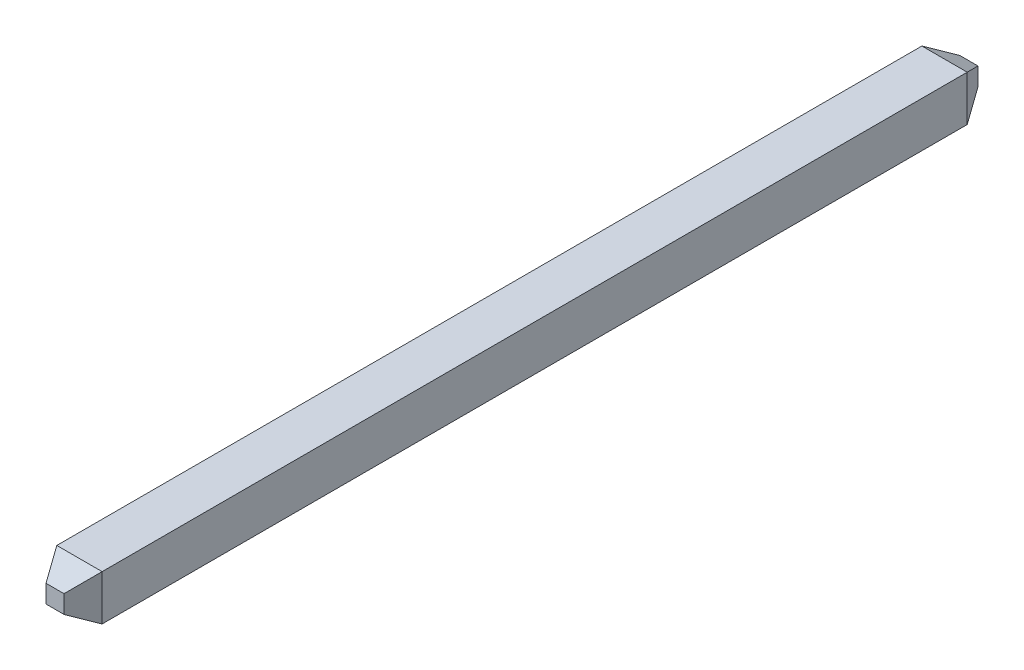
ISO-10303-21;
HEADER;
FILE_DESCRIPTION(('STEP AP214'),'2;1');
FILE_NAME('part.step','',(''),(''),'','','');
FILE_SCHEMA(('AUTOMOTIVE_DESIGN { 1 0 10303 214 1 1 1 1 }'));
ENDSEC;
DATA;
#1=APPLICATION_CONTEXT('core data for automotive mechanical design processes');
#2=APPLICATION_PROTOCOL_DEFINITION('international standard','automotive_design',2000,#1);
#3=PRODUCT_CONTEXT('',#1,'mechanical');
#4=PRODUCT('Part','Part','',(#3));
#5=PRODUCT_RELATED_PRODUCT_CATEGORY('part','',(#4));
#6=PRODUCT_DEFINITION_FORMATION('','',#4);
#7=PRODUCT_DEFINITION_CONTEXT('part definition',#1,'design');
#8=PRODUCT_DEFINITION('design','',#6,#7);
#9=PRODUCT_DEFINITION_SHAPE('','',#8);
#10=(LENGTH_UNIT() NAMED_UNIT(*) SI_UNIT(.MILLI.,.METRE.));
#11=(NAMED_UNIT(*) PLANE_ANGLE_UNIT() SI_UNIT($,.RADIAN.));
#12=(NAMED_UNIT(*) SI_UNIT($,.STERADIAN.) SOLID_ANGLE_UNIT());
#13=UNCERTAINTY_MEASURE_WITH_UNIT(LENGTH_MEASURE(1.E-05),#10,'distance_accuracy_value','');
#14=(GEOMETRIC_REPRESENTATION_CONTEXT(3) GLOBAL_UNCERTAINTY_ASSIGNED_CONTEXT((#13)) GLOBAL_UNIT_ASSIGNED_CONTEXT((#10,
#11,#12)) REPRESENTATION_CONTEXT('',''));
#15=CARTESIAN_POINT('',(0.,0.,0.));
#16=DIRECTION('',(0.,0.,1.));
#17=DIRECTION('',(1.,0.,0.));
#18=AXIS2_PLACEMENT_3D('',#15,#16,#17);
#19=CARTESIAN_POINT('',(5.20011510041924,0.945,-3.20872569516347));
#20=DIRECTION('',(0.872569516347453,0.,-0.488489958076081));
#21=DIRECTION('',(-0.488489958076081,0.,-0.872569516347453));
#22=AXIS2_PLACEMENT_3D('',#19,#20,#21);
#23=PLANE('',#22);
#24=DIRECTION('',(0.,1.,0.));
#25=VECTOR('',#24,1.);
#26=CARTESIAN_POINT('',(5.39534185664468,0.944999999999999,-2.86000017186176));
#27=LINE('',#26,#25);
#28=CARTESIAN_POINT('',(5.39534185663263,0.954999975315067,-2.85999984563027));
#29=VERTEX_POINT('',#28);
#30=CARTESIAN_POINT('',(5.39534201729187,1.58500016035866,-2.8599998849043));
#31=VERTEX_POINT('',#30);
#32=EDGE_CURVE('E146',#29,#31,#27,.T.);
#33=ORIENTED_EDGE('',*,*,#32,.F.);
#34=DIRECTION('',(0.43907261756865,-0.438284036988111,0.784297353956278));
#35=VECTOR('',#34,1.);
#36=CARTESIAN_POINT('',(5.205,1.145,-3.2));
#37=LINE('',#36,#35);
#38=CARTESIAN_POINT('',(5.205,1.145,-3.2));
#39=VERTEX_POINT('',#38);
#40=EDGE_CURVE('E143',#39,#29,#37,.T.);
#41=ORIENTED_EDGE('',*,*,#40,.F.);
#42=DIRECTION('',(0.,1.,0.));
#43=VECTOR('',#42,1.);
#44=CARTESIAN_POINT('',(5.205,1.135,-3.2));
#45=LINE('',#44,#43);
#46=CARTESIAN_POINT('',(5.205,1.395,-3.2));
#47=VERTEX_POINT('',#46);
#48=EDGE_CURVE('E95',#47,#39,#45,.F.);
#49=ORIENTED_EDGE('',*,*,#48,.F.);
#50=DIRECTION('',(-0.439072617568649,-0.438284036988111,-0.784297353956278));
#51=VECTOR('',#50,1.);
#52=CARTESIAN_POINT('',(5.39534185664468,1.585,-2.86000017186176));
#53=LINE('',#52,#51);
#54=EDGE_CURVE('E135',#31,#47,#53,.T.);
#55=ORIENTED_EDGE('',*,*,#54,.F.);
#56=EDGE_LOOP('',(#33,#41,#49,#55));
#57=FACE_BOUND('',#56,.T.);
#58=ADVANCED_FACE('F16',(#57),#23,.T.);
#59=CARTESIAN_POINT('',(5.20036702814295,0.945,9.50441734607014));
#60=DIRECTION('',(0.873317045523297,0.,0.487152273933377));
#61=DIRECTION('',(0.487152273933377,0.,-0.873317045523297));
#62=AXIS2_PLACEMENT_3D('',#59,#60,#61);
#63=PLANE('',#62);
#64=DIRECTION('',(-0.437799852400894,0.438586917260846,0.784839349959839));
#65=VECTOR('',#64,1.);
#66=CARTESIAN_POINT('',(5.39489789955164,0.954999686828527,9.15568378706484));
#67=LINE('',#66,#65);
#68=CARTESIAN_POINT('',(5.39489765454992,0.954999891076848,9.15568368845103));
#69=VERTEX_POINT('',#68);
#70=CARTESIAN_POINT('',(5.20523855088228,1.145,9.49568417561491));
#71=VERTEX_POINT('',#70);
#72=EDGE_CURVE('E152',#69,#71,#67,.T.);
#73=ORIENTED_EDGE('',*,*,#72,.F.);
#74=DIRECTION('',(0.,1.,0.));
#75=VECTOR('',#74,1.);
#76=CARTESIAN_POINT('',(5.39489853900642,0.944999999999999,9.155683722437));
#77=LINE('',#76,#75);
#78=CARTESIAN_POINT('',(5.39489765280461,1.5850001770326,9.15568371270386));
#79=VERTEX_POINT('',#78);
#80=EDGE_CURVE('E106',#79,#69,#77,.F.);
#81=ORIENTED_EDGE('',*,*,#80,.F.);
#82=DIRECTION('',(0.437799852400903,0.438586917260844,-0.784839349959835));
#83=VECTOR('',#82,1.);
#84=CARTESIAN_POINT('',(5.20523855088228,1.395,9.49568417561491));
#85=LINE('',#84,#83);
#86=CARTESIAN_POINT('',(5.20523855088228,1.395,9.49568417561491));
#87=VERTEX_POINT('',#86);
#88=EDGE_CURVE('E101',#87,#79,#85,.T.);
#89=ORIENTED_EDGE('',*,*,#88,.F.);
#90=DIRECTION('',(0.,1.,0.));
#91=VECTOR('',#90,1.);
#92=CARTESIAN_POINT('',(5.20523855088228,1.405,9.49568417561491));
#93=LINE('',#92,#91);
#94=EDGE_CURVE('E19',#71,#87,#93,.T.);
#95=ORIENTED_EDGE('',*,*,#94,.F.);
#96=EDGE_LOOP('',(#73,#81,#89,#95));
#97=FACE_BOUND('',#96,.T.);
#98=ADVANCED_FACE('F103',(#97),#63,.T.);
#99=CARTESIAN_POINT('',(4.94523855088228,1.405,9.49568417561491));
#100=DIRECTION('',(0.,0.,1.));
#101=DIRECTION('',(1.,0.,0.));
#102=AXIS2_PLACEMENT_3D('',#99,#100,#101);
#103=PLANE('',#102);
#104=DIRECTION('',(1.,0.,0.));
#105=VECTOR('',#104,1.);
#106=CARTESIAN_POINT('',(4.7548966942376,1.395,9.49568417561491));
#107=LINE('',#106,#105);
#108=CARTESIAN_POINT('',(4.95523855088228,1.395,9.49568417561491));
#109=VERTEX_POINT('',#108);
#110=EDGE_CURVE('E111',#109,#87,#107,.T.);
#111=ORIENTED_EDGE('',*,*,#110,.F.);
#112=DIRECTION('',(0.,1.,0.));
#113=VECTOR('',#112,1.);
#114=CARTESIAN_POINT('',(4.95523855088228,0.945,9.49568417561491));
#115=LINE('',#114,#113);
#116=CARTESIAN_POINT('',(4.95523855088228,1.145,9.49568417561491));
#117=VERTEX_POINT('',#116);
#118=EDGE_CURVE('E162',#117,#109,#115,.T.);
#119=ORIENTED_EDGE('',*,*,#118,.F.);
#120=DIRECTION('',(1.,0.,0.));
#121=VECTOR('',#120,1.);
#122=CARTESIAN_POINT('',(4.7548966942376,1.145,9.49568417561491));
#123=LINE('',#122,#121);
#124=EDGE_CURVE('E116',#71,#117,#123,.F.);
#125=ORIENTED_EDGE('',*,*,#124,.F.);
#126=ORIENTED_EDGE('',*,*,#94,.T.);
#127=EDGE_LOOP('',(#111,#119,#125,#126));
#128=FACE_BOUND('',#127,.T.);
#129=ADVANCED_FACE('F113',(#128),#103,.T.);
#130=CARTESIAN_POINT('',(4.7548966942376,1.39012178454432,9.50441360938624));
#131=DIRECTION('',(0.,0.872943377132664,0.487821545567864));
#132=DIRECTION('',(0.,-0.487821545567864,0.872943377132664));
#133=AXIS2_PLACEMENT_3D('',#130,#131,#132);
#134=PLANE('',#133);
#135=DIRECTION('',(-0.439072459537936,0.438284700441641,-0.78429707167252));
#136=VECTOR('',#135,1.);
#137=CARTESIAN_POINT('',(4.95523855088228,1.395,9.49568417561491));
#138=LINE('',#137,#136);
#139=CARTESIAN_POINT('',(4.7648975037028,1.58500008247257,9.15568447138297));
#140=VERTEX_POINT('',#139);
#141=EDGE_CURVE('E121',#109,#140,#138,.T.);
#142=ORIENTED_EDGE('',*,*,#141,.F.);
#143=ORIENTED_EDGE('',*,*,#110,.T.);
#144=ORIENTED_EDGE('',*,*,#88,.T.);
#145=DIRECTION('',(1.,0.,0.));
#146=VECTOR('',#145,1.);
#147=CARTESIAN_POINT('',(5.08006658937282,1.585,9.15568497320463));
#148=LINE('',#147,#146);
#149=EDGE_CURVE('E164',#140,#79,#148,.T.);
#150=ORIENTED_EDGE('',*,*,#149,.F.);
#151=EDGE_LOOP('',(#142,#143,#144,#150));
#152=FACE_BOUND('',#151,.T.);
#153=ADVANCED_FACE('F119',(#152),#134,.T.);
#154=CARTESIAN_POINT('',(4.945,1.135,-3.2));
#155=DIRECTION('',(0.,0.,-1.));
#156=DIRECTION('',(-1.,0.,0.));
#157=AXIS2_PLACEMENT_3D('',#154,#155,#156);
#158=PLANE('',#157);
#159=ORIENTED_EDGE('',*,*,#48,.T.);
#160=DIRECTION('',(1.,0.,0.));
#161=VECTOR('',#160,1.);
#162=CARTESIAN_POINT('',(4.75534185664468,1.145,-3.2));
#163=LINE('',#162,#161);
#164=CARTESIAN_POINT('',(4.955,1.145,-3.2));
#165=VERTEX_POINT('',#164);
#166=EDGE_CURVE('E139',#165,#39,#163,.T.);
#167=ORIENTED_EDGE('',*,*,#166,.F.);
#168=DIRECTION('',(0.,1.,0.));
#169=VECTOR('',#168,1.);
#170=CARTESIAN_POINT('',(4.955,0.945,-3.2));
#171=LINE('',#170,#169);
#172=CARTESIAN_POINT('',(4.955,1.395,-3.2));
#173=VERTEX_POINT('',#172);
#174=EDGE_CURVE('E176',#173,#165,#171,.F.);
#175=ORIENTED_EDGE('',*,*,#174,.F.);
#176=DIRECTION('',(1.,0.,0.));
#177=VECTOR('',#176,1.);
#178=CARTESIAN_POINT('',(4.75534185664468,1.395,-3.2));
#179=LINE('',#178,#177);
#180=EDGE_CURVE('E129',#47,#173,#179,.F.);
#181=ORIENTED_EDGE('',*,*,#180,.F.);
#182=EDGE_LOOP('',(#159,#167,#175,#181));
#183=FACE_BOUND('',#182,.T.);
#184=ADVANCED_FACE('F229',(#183),#158,.T.);
#185=CARTESIAN_POINT('',(4.75534185664468,1.58987821545568,-2.85127073809043));
#186=DIRECTION('',(0.,0.872943377132663,-0.487821545567865));
#187=DIRECTION('',(0.,0.487821545567865,0.872943377132663));
#188=AXIS2_PLACEMENT_3D('',#185,#186,#187);
#189=PLANE('',#188);
#190=DIRECTION('',(1.,0.,0.));
#191=VECTOR('',#190,1.);
#192=CARTESIAN_POINT('',(5.08006658937282,1.585,-2.86000017186176));
#193=LINE('',#192,#191);
#194=CARTESIAN_POINT('',(4.76534144768619,1.5850007068091,-2.8599984305592));
#195=VERTEX_POINT('',#194);
#196=EDGE_CURVE('E172',#31,#195,#193,.F.);
#197=ORIENTED_EDGE('',*,*,#196,.F.);
#198=ORIENTED_EDGE('',*,*,#54,.T.);
#199=ORIENTED_EDGE('',*,*,#180,.T.);
#200=DIRECTION('',(0.437798396819593,-0.438586429089661,-0.784840434713054));
#201=VECTOR('',#200,1.);
#202=CARTESIAN_POINT('',(4.76534066407532,1.58500072063078,-2.85999803394471));
#203=LINE('',#202,#201);
#204=EDGE_CURVE('E183',#195,#173,#203,.T.);
#205=ORIENTED_EDGE('',*,*,#204,.F.);
#206=EDGE_LOOP('',(#197,#198,#199,#205));
#207=FACE_BOUND('',#206,.T.);
#208=ADVANCED_FACE('F227',(#207),#189,.T.);
#209=CARTESIAN_POINT('',(4.75534185664468,1.14987821545568,-3.20872943377133));
#210=DIRECTION('',(0.,-0.872943377132663,-0.487821545567865));
#211=DIRECTION('',(0.,0.487821545567865,-0.872943377132663));
#212=AXIS2_PLACEMENT_3D('',#209,#210,#211);
#213=PLANE('',#212);
#214=ORIENTED_EDGE('',*,*,#166,.T.);
#215=ORIENTED_EDGE('',*,*,#40,.T.);
#216=DIRECTION('',(1.,0.,0.));
#217=VECTOR('',#216,1.);
#218=CARTESIAN_POINT('',(4.75494834685547,0.955,-2.85999756200982));
#219=LINE('',#218,#217);
#220=CARTESIAN_POINT('',(4.76534198218488,0.954999729763457,-2.85999898491791));
#221=VERTEX_POINT('',#220);
#222=EDGE_CURVE('E39',#221,#29,#219,.T.);
#223=ORIENTED_EDGE('',*,*,#222,.F.);
#224=DIRECTION('',(-0.437798396819592,-0.438586429089664,0.784840434713052));
#225=VECTOR('',#224,1.);
#226=CARTESIAN_POINT('',(4.955,1.145,-3.2));
#227=LINE('',#226,#225);
#228=EDGE_CURVE('E180',#165,#221,#227,.T.);
#229=ORIENTED_EDGE('',*,*,#228,.F.);
#230=EDGE_LOOP('',(#214,#215,#223,#229));
#231=FACE_BOUND('',#230,.T.);
#232=ADVANCED_FACE('F230',(#231),#213,.T.);
#233=CARTESIAN_POINT('',(5.39534630826875,0.944999999999999,-2.98065701705514));
#234=DIRECTION('',(0.999999999319383,0.,3.68949151672057E-05));
#235=DIRECTION('',(3.68949151672057E-05,0.,-0.999999999319383));
#236=AXIS2_PLACEMENT_3D('',#233,#234,#235);
#237=PLANE('',#236);
#238=DIRECTION('',(3.69481335098094E-05,0.,-0.999999999317418));
#239=VECTOR('',#238,1.);
#240=CARTESIAN_POINT('',(5.39489789955164,1.585,9.1556837224134));
#241=LINE('',#240,#239);
#242=EDGE_CURVE('E168',#79,#31,#241,.T.);
#243=ORIENTED_EDGE('',*,*,#242,.F.);
#244=ORIENTED_EDGE('',*,*,#80,.T.);
#245=DIRECTION('',(-3.69481335098094E-05,0.,0.999999999317418));
#246=VECTOR('',#245,1.);
#247=CARTESIAN_POINT('',(5.39534185664468,0.955,-2.86000017186176));
#248=LINE('',#247,#246);
#249=EDGE_CURVE('E189',#29,#69,#248,.T.);
#250=ORIENTED_EDGE('',*,*,#249,.F.);
#251=ORIENTED_EDGE('',*,*,#32,.T.);
#252=EDGE_LOOP('',(#243,#244,#250,#251));
#253=FACE_BOUND('',#252,.T.);
#254=ADVANCED_FACE('F232',(#253),#237,.T.);
#255=CARTESIAN_POINT('',(4.7548966942376,0.950121784544321,9.14695491370534));
#256=DIRECTION('',(0.,-0.872943377132664,0.487821545567865));
#257=DIRECTION('',(0.,-0.487821545567865,-0.872943377132664));
#258=AXIS2_PLACEMENT_3D('',#255,#256,#257);
#259=PLANE('',#258);
#260=ORIENTED_EDGE('',*,*,#124,.T.);
#261=DIRECTION('',(0.439072459537931,0.438284700441657,0.784297071672513));
#262=VECTOR('',#261,1.);
#263=CARTESIAN_POINT('',(4.76489724886554,0.955000197635095,9.15568533818575));
#264=LINE('',#263,#262);
#265=CARTESIAN_POINT('',(4.76489781760237,0.955000116075707,9.15568487573228));
#266=VERTEX_POINT('',#265);
#267=EDGE_CURVE('E158',#266,#117,#264,.T.);
#268=ORIENTED_EDGE('',*,*,#267,.F.);
#269=DIRECTION('',(1.,0.,0.));
#270=VECTOR('',#269,1.);
#271=CARTESIAN_POINT('',(4.75494834685547,0.955,9.15568372241339));
#272=LINE('',#271,#270);
#273=EDGE_CURVE('E193',#69,#266,#272,.F.);
#274=ORIENTED_EDGE('',*,*,#273,.F.);
#275=ORIENTED_EDGE('',*,*,#72,.T.);
#276=EDGE_LOOP('',(#260,#268,#274,#275));
#277=FACE_BOUND('',#276,.T.);
#278=ADVANCED_FACE('F219',(#277),#259,.T.);
#279=CARTESIAN_POINT('',(4.96012345046304,0.945,9.50440987077839));
#280=DIRECTION('',(-0.872569516347453,0.,0.488489958076081));
#281=DIRECTION('',(0.488489958076081,0.,0.872569516347453));
#282=AXIS2_PLACEMENT_3D('',#279,#280,#281);
#283=PLANE('',#282);
#284=ORIENTED_EDGE('',*,*,#267,.T.);
#285=ORIENTED_EDGE('',*,*,#118,.T.);
#286=ORIENTED_EDGE('',*,*,#141,.T.);
#287=DIRECTION('',(0.,1.,0.));
#288=VECTOR('',#287,1.);
#289=CARTESIAN_POINT('',(4.76489853896028,0.945,9.15568497322818));
#290=LINE('',#289,#288);
#291=EDGE_CURVE('E197',#266,#140,#290,.T.);
#292=ORIENTED_EDGE('',*,*,#291,.F.);
#293=EDGE_LOOP('',(#284,#285,#286,#292));
#294=FACE_BOUND('',#293,.T.);
#295=ADVANCED_FACE('F222',(#294),#283,.T.);
#296=CARTESIAN_POINT('',(5.08006658937282,1.585,9.32634470275115));
#297=DIRECTION('',(0.,1.,0.));
#298=DIRECTION('',(0.,0.,1.));
#299=AXIS2_PLACEMENT_3D('',#296,#297,#298);
#300=PLANE('',#299);
#301=ORIENTED_EDGE('',*,*,#196,.T.);
#302=DIRECTION('',(-3.68949151674615E-05,0.,0.999999999319383));
#303=VECTOR('',#302,1.);
#304=CARTESIAN_POINT('',(4.76489224235438,1.5849998023649,9.32634821671993));
#305=LINE('',#304,#303);
#306=EDGE_CURVE('E201',#140,#195,#305,.F.);
#307=ORIENTED_EDGE('',*,*,#306,.F.);
#308=ORIENTED_EDGE('',*,*,#149,.T.);
#309=ORIENTED_EDGE('',*,*,#242,.T.);
#310=EDGE_LOOP('',(#301,#307,#308,#309));
#311=FACE_BOUND('',#310,.T.);
#312=ADVANCED_FACE('F224',(#311),#300,.T.);
#313=CARTESIAN_POINT('',(4.95987152273933,0.945,-3.20873317045523));
#314=DIRECTION('',(-0.873317045523297,0.,-0.487152273933377));
#315=DIRECTION('',(-0.487152273933377,0.,0.873317045523297));
#316=AXIS2_PLACEMENT_3D('',#313,#314,#315);
#317=PLANE('',#316);
#318=DIRECTION('',(0.,1.,0.));
#319=VECTOR('',#318,1.);
#320=CARTESIAN_POINT('',(4.76534185654839,0.945,-2.85999756199704));
#321=LINE('',#320,#319);
#322=EDGE_CURVE('E26',#195,#221,#321,.F.);
#323=ORIENTED_EDGE('',*,*,#322,.F.);
#324=ORIENTED_EDGE('',*,*,#204,.T.);
#325=ORIENTED_EDGE('',*,*,#174,.T.);
#326=ORIENTED_EDGE('',*,*,#228,.T.);
#327=EDGE_LOOP('',(#323,#324,#325,#326));
#328=FACE_BOUND('',#327,.T.);
#329=ADVANCED_FACE('F213',(#328),#317,.T.);
#330=CARTESIAN_POINT('',(4.75494834685547,0.955,3.17284922525592));
#331=DIRECTION('',(0.,-1.,0.));
#332=DIRECTION('',(0.,0.,-1.));
#333=AXIS2_PLACEMENT_3D('',#330,#331,#332);
#334=PLANE('',#333);
#335=ORIENTED_EDGE('',*,*,#249,.T.);
#336=ORIENTED_EDGE('',*,*,#273,.T.);
#337=DIRECTION('',(-3.68949151674615E-05,0.,0.999999999319383));
#338=VECTOR('',#337,1.);
#339=CARTESIAN_POINT('',(4.76489224235438,0.954999279369218,9.32634821671993));
#340=LINE('',#339,#338);
#341=EDGE_CURVE('E11',#221,#266,#340,.T.);
#342=ORIENTED_EDGE('',*,*,#341,.F.);
#343=ORIENTED_EDGE('',*,*,#222,.T.);
#344=EDGE_LOOP('',(#335,#336,#342,#343));
#345=FACE_BOUND('',#344,.T.);
#346=ADVANCED_FACE('F215',(#345),#334,.T.);
#347=CARTESIAN_POINT('',(4.76489224235438,0.945,9.32634821671993));
#348=DIRECTION('',(-0.999999999319383,0.,-3.68949151674615E-05));
#349=DIRECTION('',(-3.68949151674615E-05,0.,0.999999999319383));
#350=AXIS2_PLACEMENT_3D('',#347,#348,#349);
#351=PLANE('',#350);
#352=ORIENTED_EDGE('',*,*,#322,.T.);
#353=ORIENTED_EDGE('',*,*,#341,.T.);
#354=ORIENTED_EDGE('',*,*,#291,.T.);
#355=ORIENTED_EDGE('',*,*,#306,.T.);
#356=EDGE_LOOP('',(#352,#353,#354,#355));
#357=FACE_BOUND('',#356,.T.);
#358=ADVANCED_FACE('F209',(#357),#351,.T.);
#359=CLOSED_SHELL('',(#58,#98,#129,#153,#184,#208,#232,#254,#278,#295,#312,#329,#346,#358));
#360=MANIFOLD_SOLID_BREP('B1',#359);
#361=ADVANCED_BREP_SHAPE_REPRESENTATION('',(#18,#360),#14);
#362=SHAPE_DEFINITION_REPRESENTATION(#9,#361);
ENDSEC;
END-ISO-10303-21;
